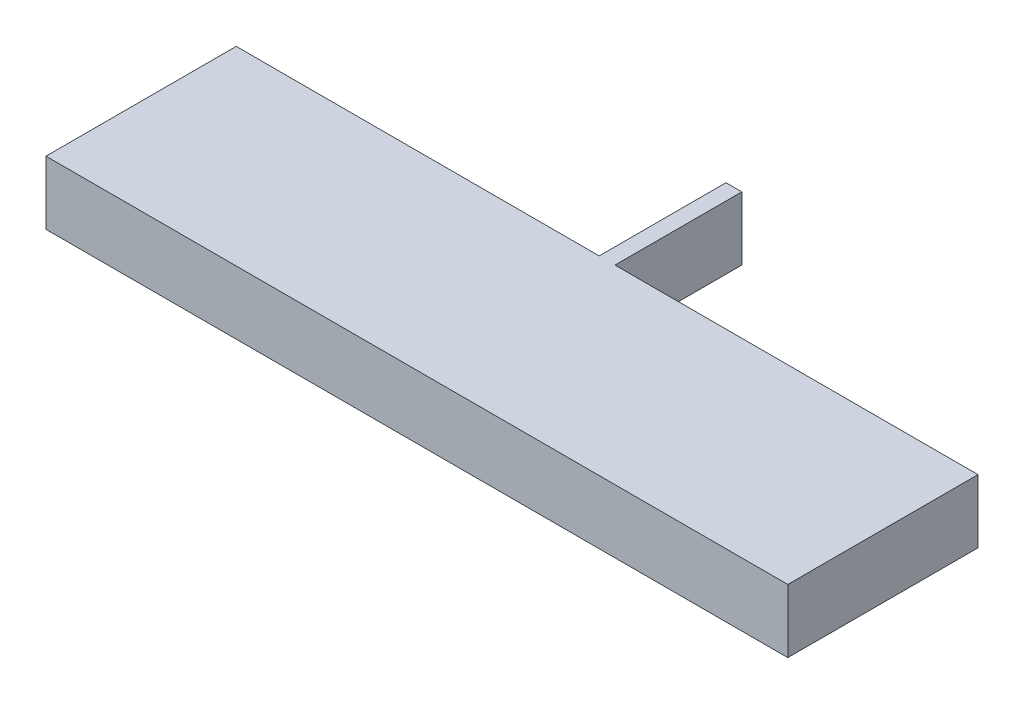
ISO-10303-21;
HEADER;
FILE_DESCRIPTION(('STEP AP214'),'2;1');
FILE_NAME('part.step','',(''),(''),'','','');
FILE_SCHEMA(('AUTOMOTIVE_DESIGN { 1 0 10303 214 1 1 1 1 }'));
ENDSEC;
DATA;
#1=APPLICATION_CONTEXT('core data for automotive mechanical design processes');
#2=APPLICATION_PROTOCOL_DEFINITION('international standard','automotive_design',2000,#1);
#3=PRODUCT_CONTEXT('',#1,'mechanical');
#4=PRODUCT('Part','Part','',(#3));
#5=PRODUCT_RELATED_PRODUCT_CATEGORY('part','',(#4));
#6=PRODUCT_DEFINITION_FORMATION('','',#4);
#7=PRODUCT_DEFINITION_CONTEXT('part definition',#1,'design');
#8=PRODUCT_DEFINITION('design','',#6,#7);
#9=PRODUCT_DEFINITION_SHAPE('','',#8);
#10=(LENGTH_UNIT() NAMED_UNIT(*) SI_UNIT(.MILLI.,.METRE.));
#11=(NAMED_UNIT(*) PLANE_ANGLE_UNIT() SI_UNIT($,.RADIAN.));
#12=(NAMED_UNIT(*) SI_UNIT($,.STERADIAN.) SOLID_ANGLE_UNIT());
#13=UNCERTAINTY_MEASURE_WITH_UNIT(LENGTH_MEASURE(1.E-05),#10,'distance_accuracy_value','');
#14=(GEOMETRIC_REPRESENTATION_CONTEXT(3) GLOBAL_UNCERTAINTY_ASSIGNED_CONTEXT((#13)) GLOBAL_UNIT_ASSIGNED_CONTEXT((#10,
#11,#12)) REPRESENTATION_CONTEXT('',''));
#15=CARTESIAN_POINT('',(0.,0.,0.));
#16=DIRECTION('',(0.,0.,1.));
#17=DIRECTION('',(1.,0.,0.));
#18=AXIS2_PLACEMENT_3D('',#15,#16,#17);
#19=CARTESIAN_POINT('',(-11.7,2.,-2.99999999999999));
#20=DIRECTION('',(1.,0.,0.));
#21=DIRECTION('',(0.,0.,-1.));
#22=AXIS2_PLACEMENT_3D('',#19,#20,#21);
#23=PLANE('',#22);
#24=DIRECTION('',(0.,0.,1.));
#25=VECTOR('',#24,1.);
#26=CARTESIAN_POINT('',(-11.7,0.,-2.99999999999999));
#27=LINE('',#26,#25);
#28=CARTESIAN_POINT('',(-11.7,0.,-2.99999999999999));
#29=VERTEX_POINT('',#28);
#30=CARTESIAN_POINT('',(-11.7,0.,3.));
#31=VERTEX_POINT('',#30);
#32=EDGE_CURVE('E136',#29,#31,#27,.T.);
#33=ORIENTED_EDGE('',*,*,#32,.T.);
#34=DIRECTION('',(0.,-1.,0.));
#35=VECTOR('',#34,1.);
#36=CARTESIAN_POINT('',(-11.7,2.,3.));
#37=LINE('',#36,#35);
#38=CARTESIAN_POINT('',(-11.7,2.,3.));
#39=VERTEX_POINT('',#38);
#40=EDGE_CURVE('E12',#39,#31,#37,.T.);
#41=ORIENTED_EDGE('',*,*,#40,.F.);
#42=DIRECTION('',(0.,0.,1.));
#43=VECTOR('',#42,1.);
#44=CARTESIAN_POINT('',(-11.7,2.,-2.99999999999999));
#45=LINE('',#44,#43);
#46=CARTESIAN_POINT('',(-11.7,2.,-2.99999999999999));
#47=VERTEX_POINT('',#46);
#48=EDGE_CURVE('E150',#47,#39,#45,.T.);
#49=ORIENTED_EDGE('',*,*,#48,.F.);
#50=DIRECTION('',(0.,-1.,0.));
#51=VECTOR('',#50,1.);
#52=CARTESIAN_POINT('',(-11.7,2.,-2.99999999999999));
#53=LINE('',#52,#51);
#54=EDGE_CURVE('E132',#47,#29,#53,.T.);
#55=ORIENTED_EDGE('',*,*,#54,.T.);
#56=EDGE_LOOP('',(#33,#41,#49,#55));
#57=FACE_BOUND('',#56,.T.);
#58=ADVANCED_FACE('F40',(#57),#23,.F.);
#59=CARTESIAN_POINT('',(-11.7,2.,3.));
#60=DIRECTION('',(0.,0.,-1.));
#61=DIRECTION('',(-1.,0.,0.));
#62=AXIS2_PLACEMENT_3D('',#59,#60,#61);
#63=PLANE('',#62);
#64=DIRECTION('',(1.,0.,0.));
#65=VECTOR('',#64,1.);
#66=CARTESIAN_POINT('',(-11.7,0.,3.));
#67=LINE('',#66,#65);
#68=CARTESIAN_POINT('',(11.7,0.,2.99999999999999));
#69=VERTEX_POINT('',#68);
#70=EDGE_CURVE('E139',#31,#69,#67,.T.);
#71=ORIENTED_EDGE('',*,*,#70,.T.);
#72=DIRECTION('',(0.,-1.,0.));
#73=VECTOR('',#72,1.);
#74=CARTESIAN_POINT('',(11.7,2.,2.99999999999999));
#75=LINE('',#74,#73);
#76=CARTESIAN_POINT('',(11.7,2.,2.99999999999999));
#77=VERTEX_POINT('',#76);
#78=EDGE_CURVE('E48',#77,#69,#75,.T.);
#79=ORIENTED_EDGE('',*,*,#78,.F.);
#80=DIRECTION('',(1.,0.,0.));
#81=VECTOR('',#80,1.);
#82=CARTESIAN_POINT('',(-11.7,2.,3.));
#83=LINE('',#82,#81);
#84=EDGE_CURVE('E99',#39,#77,#83,.T.);
#85=ORIENTED_EDGE('',*,*,#84,.F.);
#86=ORIENTED_EDGE('',*,*,#40,.T.);
#87=EDGE_LOOP('',(#71,#79,#85,#86));
#88=FACE_BOUND('',#87,.T.);
#89=ADVANCED_FACE('F185',(#88),#63,.F.);
#90=CARTESIAN_POINT('',(11.7,2.,-3.));
#91=DIRECTION('',(-1.,0.,0.));
#92=DIRECTION('',(0.,0.,1.));
#93=AXIS2_PLACEMENT_3D('',#90,#91,#92);
#94=PLANE('',#93);
#95=DIRECTION('',(0.,0.,-1.));
#96=VECTOR('',#95,1.);
#97=CARTESIAN_POINT('',(11.7,0.,-3.));
#98=LINE('',#97,#96);
#99=CARTESIAN_POINT('',(11.7,0.,-3.));
#100=VERTEX_POINT('',#99);
#101=EDGE_CURVE('E141',#69,#100,#98,.T.);
#102=ORIENTED_EDGE('',*,*,#101,.T.);
#103=DIRECTION('',(0.,-1.,0.));
#104=VECTOR('',#103,1.);
#105=CARTESIAN_POINT('',(11.7,2.,-3.));
#106=LINE('',#105,#104);
#107=CARTESIAN_POINT('',(11.7,2.,-3.));
#108=VERTEX_POINT('',#107);
#109=EDGE_CURVE('E157',#108,#100,#106,.T.);
#110=ORIENTED_EDGE('',*,*,#109,.F.);
#111=DIRECTION('',(0.,0.,-1.));
#112=VECTOR('',#111,1.);
#113=CARTESIAN_POINT('',(11.7,2.,-3.));
#114=LINE('',#113,#112);
#115=EDGE_CURVE('E165',#77,#108,#114,.T.);
#116=ORIENTED_EDGE('',*,*,#115,.F.);
#117=ORIENTED_EDGE('',*,*,#78,.T.);
#118=EDGE_LOOP('',(#102,#110,#116,#117));
#119=FACE_BOUND('',#118,.T.);
#120=ADVANCED_FACE('F163',(#119),#94,.F.);
#121=CARTESIAN_POINT('',(0.25,2.,-3.));
#122=DIRECTION('',(0.,0.,1.));
#123=DIRECTION('',(1.,0.,0.));
#124=AXIS2_PLACEMENT_3D('',#121,#122,#123);
#125=PLANE('',#124);
#126=DIRECTION('',(-1.,0.,0.));
#127=VECTOR('',#126,1.);
#128=CARTESIAN_POINT('',(0.25,0.,-3.));
#129=LINE('',#128,#127);
#130=CARTESIAN_POINT('',(0.25,0.,-3.));
#131=VERTEX_POINT('',#130);
#132=EDGE_CURVE('E143',#100,#131,#129,.T.);
#133=ORIENTED_EDGE('',*,*,#132,.T.);
#134=DIRECTION('',(0.,-1.,0.));
#135=VECTOR('',#134,1.);
#136=CARTESIAN_POINT('',(0.25,2.,-3.));
#137=LINE('',#136,#135);
#138=CARTESIAN_POINT('',(0.25,2.,-3.));
#139=VERTEX_POINT('',#138);
#140=EDGE_CURVE('E154',#139,#131,#137,.T.);
#141=ORIENTED_EDGE('',*,*,#140,.F.);
#142=DIRECTION('',(-1.,0.,0.));
#143=VECTOR('',#142,1.);
#144=CARTESIAN_POINT('',(0.25,2.,-3.));
#145=LINE('',#144,#143);
#146=EDGE_CURVE('E177',#108,#139,#145,.T.);
#147=ORIENTED_EDGE('',*,*,#146,.F.);
#148=ORIENTED_EDGE('',*,*,#109,.T.);
#149=EDGE_LOOP('',(#133,#141,#147,#148));
#150=FACE_BOUND('',#149,.T.);
#151=ADVANCED_FACE('F173',(#150),#125,.F.);
#152=CARTESIAN_POINT('',(0.249999999999999,2.,-6.99999999999999));
#153=DIRECTION('',(-1.,0.,0.));
#154=DIRECTION('',(0.,0.,1.));
#155=AXIS2_PLACEMENT_3D('',#152,#153,#154);
#156=PLANE('',#155);
#157=DIRECTION('',(0.,0.,-1.));
#158=VECTOR('',#157,1.);
#159=CARTESIAN_POINT('',(0.249999999999999,0.,-6.99999999999999));
#160=LINE('',#159,#158);
#161=CARTESIAN_POINT('',(0.249999999999999,0.,-6.99999999999999));
#162=VERTEX_POINT('',#161);
#163=EDGE_CURVE('E145',#131,#162,#160,.T.);
#164=ORIENTED_EDGE('',*,*,#163,.T.);
#165=DIRECTION('',(0.,-1.,0.));
#166=VECTOR('',#165,1.);
#167=CARTESIAN_POINT('',(0.249999999999999,2.,-6.99999999999999));
#168=LINE('',#167,#166);
#169=CARTESIAN_POINT('',(0.249999999999999,2.,-6.99999999999999));
#170=VERTEX_POINT('',#169);
#171=EDGE_CURVE('E127',#170,#162,#168,.T.);
#172=ORIENTED_EDGE('',*,*,#171,.F.);
#173=DIRECTION('',(0.,0.,-1.));
#174=VECTOR('',#173,1.);
#175=CARTESIAN_POINT('',(0.249999999999999,2.,-6.99999999999999));
#176=LINE('',#175,#174);
#177=EDGE_CURVE('E118',#139,#170,#176,.T.);
#178=ORIENTED_EDGE('',*,*,#177,.F.);
#179=ORIENTED_EDGE('',*,*,#140,.T.);
#180=EDGE_LOOP('',(#164,#172,#178,#179));
#181=FACE_BOUND('',#180,.T.);
#182=ADVANCED_FACE('F176',(#181),#156,.F.);
#183=CARTESIAN_POINT('',(-0.250000000000001,2.,-6.99999999999999));
#184=DIRECTION('',(0.,0.,1.));
#185=DIRECTION('',(1.,0.,0.));
#186=AXIS2_PLACEMENT_3D('',#183,#184,#185);
#187=PLANE('',#186);
#188=DIRECTION('',(-1.,0.,0.));
#189=VECTOR('',#188,1.);
#190=CARTESIAN_POINT('',(-0.250000000000001,0.,-6.99999999999999));
#191=LINE('',#190,#189);
#192=CARTESIAN_POINT('',(-0.250000000000001,0.,-6.99999999999999));
#193=VERTEX_POINT('',#192);
#194=EDGE_CURVE('E126',#162,#193,#191,.T.);
#195=ORIENTED_EDGE('',*,*,#194,.T.);
#196=DIRECTION('',(0.,-1.,0.));
#197=VECTOR('',#196,1.);
#198=CARTESIAN_POINT('',(-0.250000000000001,2.,-6.99999999999999));
#199=LINE('',#198,#197);
#200=CARTESIAN_POINT('',(-0.250000000000001,2.,-6.99999999999999));
#201=VERTEX_POINT('',#200);
#202=EDGE_CURVE('E123',#201,#193,#199,.T.);
#203=ORIENTED_EDGE('',*,*,#202,.F.);
#204=DIRECTION('',(-1.,0.,0.));
#205=VECTOR('',#204,1.);
#206=CARTESIAN_POINT('',(-0.250000000000001,2.,-6.99999999999999));
#207=LINE('',#206,#205);
#208=EDGE_CURVE('E112',#170,#201,#207,.T.);
#209=ORIENTED_EDGE('',*,*,#208,.F.);
#210=ORIENTED_EDGE('',*,*,#171,.T.);
#211=EDGE_LOOP('',(#195,#203,#209,#210));
#212=FACE_BOUND('',#211,.T.);
#213=ADVANCED_FACE('F124',(#212),#187,.F.);
#214=CARTESIAN_POINT('',(-0.250000000000001,2.,-6.99999999999999));
#215=DIRECTION('',(1.,0.,0.));
#216=DIRECTION('',(0.,0.,-1.));
#217=AXIS2_PLACEMENT_3D('',#214,#215,#216);
#218=PLANE('',#217);
#219=DIRECTION('',(0.,0.,1.));
#220=VECTOR('',#219,1.);
#221=CARTESIAN_POINT('',(-0.250000000000001,0.,-6.99999999999999));
#222=LINE('',#221,#220);
#223=CARTESIAN_POINT('',(-0.25,0.,-3.));
#224=VERTEX_POINT('',#223);
#225=EDGE_CURVE('E85',#193,#224,#222,.T.);
#226=ORIENTED_EDGE('',*,*,#225,.T.);
#227=DIRECTION('',(0.,-1.,0.));
#228=VECTOR('',#227,1.);
#229=CARTESIAN_POINT('',(-0.25,2.,-3.));
#230=LINE('',#229,#228);
#231=CARTESIAN_POINT('',(-0.25,2.,-3.));
#232=VERTEX_POINT('',#231);
#233=EDGE_CURVE('E128',#232,#224,#230,.T.);
#234=ORIENTED_EDGE('',*,*,#233,.F.);
#235=DIRECTION('',(0.,0.,1.));
#236=VECTOR('',#235,1.);
#237=CARTESIAN_POINT('',(-0.250000000000001,2.,-6.99999999999999));
#238=LINE('',#237,#236);
#239=EDGE_CURVE('E116',#201,#232,#238,.T.);
#240=ORIENTED_EDGE('',*,*,#239,.F.);
#241=ORIENTED_EDGE('',*,*,#202,.T.);
#242=EDGE_LOOP('',(#226,#234,#240,#241));
#243=FACE_BOUND('',#242,.T.);
#244=ADVANCED_FACE('F130',(#243),#218,.F.);
#245=CARTESIAN_POINT('',(-11.7,2.,-2.99999999999999));
#246=DIRECTION('',(0.,0.,1.));
#247=DIRECTION('',(1.,0.,0.));
#248=AXIS2_PLACEMENT_3D('',#245,#246,#247);
#249=PLANE('',#248);
#250=DIRECTION('',(-1.,0.,0.));
#251=VECTOR('',#250,1.);
#252=CARTESIAN_POINT('',(-11.7,0.,-2.99999999999999));
#253=LINE('',#252,#251);
#254=EDGE_CURVE('E91',#224,#29,#253,.T.);
#255=ORIENTED_EDGE('',*,*,#254,.T.);
#256=ORIENTED_EDGE('',*,*,#54,.F.);
#257=DIRECTION('',(-1.,0.,0.));
#258=VECTOR('',#257,1.);
#259=CARTESIAN_POINT('',(-11.7,2.,-2.99999999999999));
#260=LINE('',#259,#258);
#261=EDGE_CURVE('E56',#232,#47,#260,.T.);
#262=ORIENTED_EDGE('',*,*,#261,.F.);
#263=ORIENTED_EDGE('',*,*,#233,.T.);
#264=EDGE_LOOP('',(#255,#256,#262,#263));
#265=FACE_BOUND('',#264,.T.);
#266=ADVANCED_FACE('F201',(#265),#249,.F.);
#267=CARTESIAN_POINT('',(0.,2.,0.));
#268=DIRECTION('',(0.,1.,0.));
#269=DIRECTION('',(0.,0.,1.));
#270=AXIS2_PLACEMENT_3D('',#267,#268,#269);
#271=PLANE('',#270);
#272=ORIENTED_EDGE('',*,*,#48,.T.);
#273=ORIENTED_EDGE('',*,*,#84,.T.);
#274=ORIENTED_EDGE('',*,*,#115,.T.);
#275=ORIENTED_EDGE('',*,*,#146,.T.);
#276=ORIENTED_EDGE('',*,*,#177,.T.);
#277=ORIENTED_EDGE('',*,*,#208,.T.);
#278=ORIENTED_EDGE('',*,*,#239,.T.);
#279=ORIENTED_EDGE('',*,*,#261,.T.);
#280=EDGE_LOOP('',(#272,#273,#274,#275,#276,#277,#278,#279));
#281=FACE_BOUND('',#280,.T.);
#282=ADVANCED_FACE('F114',(#281),#271,.T.);
#283=CARTESIAN_POINT('',(0.,0.,0.));
#284=DIRECTION('',(0.,1.,0.));
#285=DIRECTION('',(0.,0.,1.));
#286=AXIS2_PLACEMENT_3D('',#283,#284,#285);
#287=PLANE('',#286);
#288=ORIENTED_EDGE('',*,*,#32,.F.);
#289=ORIENTED_EDGE('',*,*,#254,.F.);
#290=ORIENTED_EDGE('',*,*,#225,.F.);
#291=ORIENTED_EDGE('',*,*,#194,.F.);
#292=ORIENTED_EDGE('',*,*,#163,.F.);
#293=ORIENTED_EDGE('',*,*,#132,.F.);
#294=ORIENTED_EDGE('',*,*,#101,.F.);
#295=ORIENTED_EDGE('',*,*,#70,.F.);
#296=EDGE_LOOP('',(#288,#289,#290,#291,#292,#293,#294,#295));
#297=FACE_BOUND('',#296,.T.);
#298=ADVANCED_FACE('F169',(#297),#287,.F.);
#299=CLOSED_SHELL('',(#58,#89,#120,#151,#182,#213,#244,#266,#282,#298));
#300=MANIFOLD_SOLID_BREP('B2',#299);
#301=ADVANCED_BREP_SHAPE_REPRESENTATION('',(#18,#300),#14);
#302=SHAPE_DEFINITION_REPRESENTATION(#9,#301);
ENDSEC;
END-ISO-10303-21;
